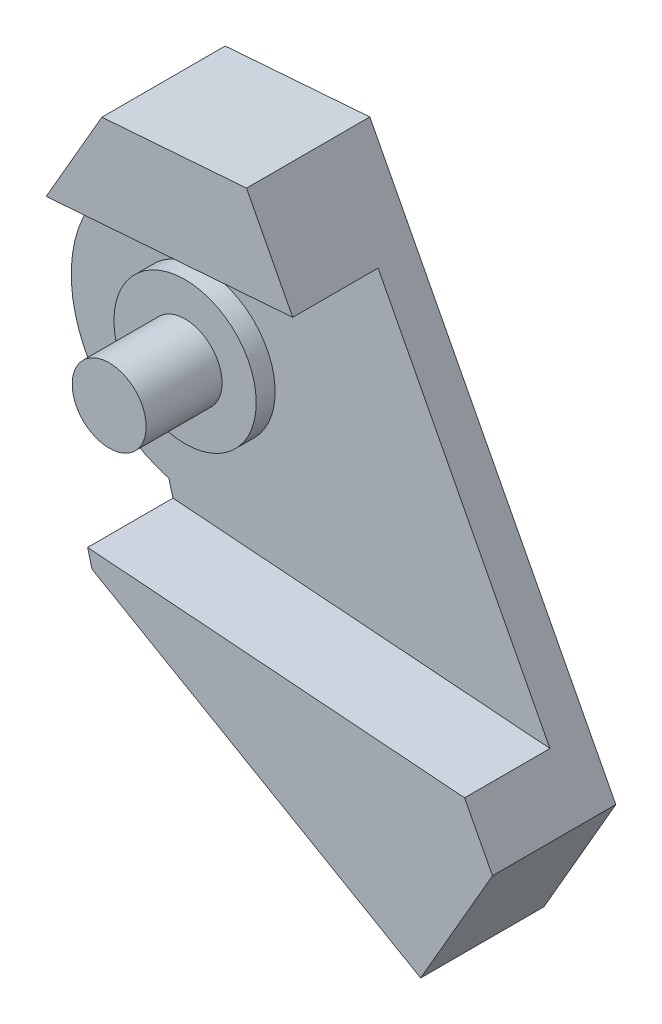
ISO-10303-21;
HEADER;
FILE_DESCRIPTION(('STEP AP214'),'2;1');
FILE_NAME('part.step','',(''),(''),'','','');
FILE_SCHEMA(('AUTOMOTIVE_DESIGN { 1 0 10303 214 1 1 1 1 }'));
ENDSEC;
DATA;
#1=APPLICATION_CONTEXT('core data for automotive mechanical design processes');
#2=APPLICATION_PROTOCOL_DEFINITION('international standard','automotive_design',2000,#1);
#3=PRODUCT_CONTEXT('',#1,'mechanical');
#4=PRODUCT('Part','Part','',(#3));
#5=PRODUCT_RELATED_PRODUCT_CATEGORY('part','',(#4));
#6=PRODUCT_DEFINITION_FORMATION('','',#4);
#7=PRODUCT_DEFINITION_CONTEXT('part definition',#1,'design');
#8=PRODUCT_DEFINITION('design','',#6,#7);
#9=PRODUCT_DEFINITION_SHAPE('','',#8);
#10=(LENGTH_UNIT() NAMED_UNIT(*) SI_UNIT(.MILLI.,.METRE.));
#11=(NAMED_UNIT(*) PLANE_ANGLE_UNIT() SI_UNIT($,.RADIAN.));
#12=(NAMED_UNIT(*) SI_UNIT($,.STERADIAN.) SOLID_ANGLE_UNIT());
#13=UNCERTAINTY_MEASURE_WITH_UNIT(LENGTH_MEASURE(1.E-05),#10,'distance_accuracy_value','');
#14=(GEOMETRIC_REPRESENTATION_CONTEXT(3) GLOBAL_UNCERTAINTY_ASSIGNED_CONTEXT((#13)) GLOBAL_UNIT_ASSIGNED_CONTEXT((#10,
#11,#12)) REPRESENTATION_CONTEXT('',''));
#15=CARTESIAN_POINT('',(0.,0.,0.));
#16=DIRECTION('',(0.,0.,1.));
#17=DIRECTION('',(1.,0.,0.));
#18=AXIS2_PLACEMENT_3D('',#15,#16,#17);
#19=CARTESIAN_POINT('',(0.,0.,-6.99999999999928));
#20=DIRECTION('',(0.,0.,-1.));
#21=DIRECTION('',(-1.,0.,0.));
#22=AXIS2_PLACEMENT_3D('',#19,#20,#21);
#23=PLANE('',#22);
#24=CARTESIAN_POINT('',(-59.9999999999944,0.,-6.99999999999928));
#25=DIRECTION('',(0.,0.,-1.));
#26=DIRECTION('',(-1.,0.,0.));
#27=AXIS2_PLACEMENT_3D('',#24,#25,#26);
#28=CIRCLE('',#27,3.75);
#29=CARTESIAN_POINT('',(-63.7499999999944,0.,-6.99999999999928));
#30=VERTEX_POINT('',#29);
#31=EDGE_CURVE('E11',#30,#30,#28,.F.);
#32=ORIENTED_EDGE('',*,*,#31,.F.);
#33=EDGE_LOOP('',(#32));
#34=FACE_BOUND('',#33,.T.);
#35=DIRECTION('',(-0.5,-0.866025403784439,0.));
#36=VECTOR('',#35,1.);
#37=CARTESIAN_POINT('',(-70.0621778264898,-3.42820323027366,-6.99999999999928));
#38=LINE('',#37,#36);
#39=CARTESIAN_POINT('',(-63.819558369945,7.38433084077987,-6.99999999999928));
#40=VERTEX_POINT('',#39);
#41=CARTESIAN_POINT('',(-66.0621778264895,3.50000000000232,-6.99999999999928));
#42=VERTEX_POINT('',#41);
#43=EDGE_CURVE('E137',#40,#42,#38,.T.);
#44=ORIENTED_EDGE('',*,*,#43,.T.);
#45=CARTESIAN_POINT('',(-59.9999999999944,0.,-6.99999999999928));
#46=DIRECTION('',(0.,0.,-1.));
#47=DIRECTION('',(-1.,0.,0.));
#48=AXIS2_PLACEMENT_3D('',#45,#46,#47);
#49=CIRCLE('',#48,7.00000000000463);
#50=CARTESIAN_POINT('',(-61.8514022990504,-6.75072659253172,-6.99999999999928));
#51=VERTEX_POINT('',#50);
#52=EDGE_CURVE('E107',#42,#51,#49,.F.);
#53=ORIENTED_EDGE('',*,*,#52,.T.);
#54=DIRECTION('',(0.258819045102521,-0.965925826289068,0.));
#55=VECTOR('',#54,1.);
#56=CARTESIAN_POINT('',(-59.3958256229926,-15.9150635094607,-6.99999999999928));
#57=LINE('',#56,#55);
#58=CARTESIAN_POINT('',(-61.6376568001871,-7.54843565417865,-6.99999999999928));
#59=VERTEX_POINT('',#58);
#60=EDGE_CURVE('E164',#51,#59,#57,.T.);
#61=ORIENTED_EDGE('',*,*,#60,.T.);
#62=DIRECTION('',(-0.997183533758957,0.075,0.));
#63=VECTOR('',#62,1.);
#64=CARTESIAN_POINT('',(-0.91125,-12.1157799351713,-6.99999999999928));
#65=LINE('',#64,#63);
#66=CARTESIAN_POINT('',(-41.7638339135907,-9.04318227406721,-6.99999999999928));
#67=VERTEX_POINT('',#66);
#68=EDGE_CURVE('E39',#67,#59,#65,.T.);
#69=ORIENTED_EDGE('',*,*,#68,.F.);
#70=DIRECTION('',(-0.461748613235033,0.887010833178222,0.));
#71=VECTOR('',#70,1.);
#72=CARTESIAN_POINT('',(-40.2935894276389,-11.8674956538585,-6.99999999999928));
#73=LINE('',#72,#71);
#74=CARTESIAN_POINT('',(-50.8242583631366,8.36173115628311,-6.99999999999928));
#75=VERTEX_POINT('',#74);
#76=EDGE_CURVE('E135',#67,#75,#73,.T.);
#77=ORIENTED_EDGE('',*,*,#76,.T.);
#78=DIRECTION('',(-0.997183533758957,-0.075,0.));
#79=VECTOR('',#78,1.);
#80=CARTESIAN_POINT('',(-0.91125,12.1157799351713,-6.99999999999928));
#81=LINE('',#80,#79);
#82=EDGE_CURVE('E185',#75,#40,#81,.T.);
#83=ORIENTED_EDGE('',*,*,#82,.T.);
#84=EDGE_LOOP('',(#44,#53,#61,#69,#77,#83));
#85=FACE_BOUND('',#84,.T.);
#86=ADVANCED_FACE('F16',(#34,#85),#23,.F.);
#87=CARTESIAN_POINT('',(-40.2935894276389,-11.8674956538585,-8.99999999999928));
#88=DIRECTION('',(0.866025403784439,-0.5,0.));
#89=DIRECTION('',(0.5,0.866025403784439,0.));
#90=AXIS2_PLACEMENT_3D('',#87,#88,#89);
#91=PLANE('',#90);
#92=DIRECTION('',(0.,0.,1.));
#93=VECTOR('',#92,1.);
#94=CARTESIAN_POINT('',(-40.2935894276389,-11.8674956538585,-8.99999999999928));
#95=LINE('',#94,#93);
#96=CARTESIAN_POINT('',(-40.2935894276389,-11.8674956538585,-8.99999999999928));
#97=VERTEX_POINT('',#96);
#98=CARTESIAN_POINT('',(-40.2935894276389,-11.8674956538585,-2.49999999999928));
#99=VERTEX_POINT('',#98);
#100=EDGE_CURVE('E129',#97,#99,#95,.T.);
#101=ORIENTED_EDGE('',*,*,#100,.T.);
#102=DIRECTION('',(0.5,0.866025403784439,0.));
#103=VECTOR('',#102,1.);
#104=CARTESIAN_POINT('',(-25.0814157129578,14.480762113533,-2.49999999999928));
#105=LINE('',#104,#103);
#106=CARTESIAN_POINT('',(-44.0814157129566,-18.4282032302736,-2.49999999999928));
#107=VERTEX_POINT('',#106);
#108=EDGE_CURVE('E178',#107,#99,#105,.T.);
#109=ORIENTED_EDGE('',*,*,#108,.F.);
#110=DIRECTION('',(0.,0.,1.));
#111=VECTOR('',#110,1.);
#112=CARTESIAN_POINT('',(-44.0814157129566,-18.4282032302736,-8.99999999999928));
#113=LINE('',#112,#111);
#114=CARTESIAN_POINT('',(-44.0814157129566,-18.4282032302736,-8.99999999999928));
#115=VERTEX_POINT('',#114);
#116=EDGE_CURVE('E141',#115,#107,#113,.T.);
#117=ORIENTED_EDGE('',*,*,#116,.F.);
#118=DIRECTION('',(0.5,0.866025403784439,0.));
#119=VECTOR('',#118,1.);
#120=CARTESIAN_POINT('',(-40.2935894276389,-11.8674956538585,-8.99999999999928));
#121=LINE('',#120,#119);
#122=EDGE_CURVE('E140',#115,#97,#121,.T.);
#123=ORIENTED_EDGE('',*,*,#122,.T.);
#124=EDGE_LOOP('',(#101,#109,#117,#123));
#125=FACE_BOUND('',#124,.T.);
#126=ADVANCED_FACE('F18',(#125),#91,.T.);
#127=CARTESIAN_POINT('',(-44.0814157129566,-18.4282032302736,-8.99999999999928));
#128=DIRECTION('',(-0.5,-0.866025403784439,0.));
#129=DIRECTION('',(0.866025403784439,-0.5,0.));
#130=AXIS2_PLACEMENT_3D('',#127,#128,#129);
#131=PLANE('',#130);
#132=DIRECTION('',(0.,0.,1.));
#133=VECTOR('',#132,1.);
#134=CARTESIAN_POINT('',(-61.4019237886454,-8.42820323027366,-8.99999999999928));
#135=LINE('',#134,#133);
#136=CARTESIAN_POINT('',(-61.4019237886454,-8.42820323027366,-8.99999999999928));
#137=VERTEX_POINT('',#136);
#138=CARTESIAN_POINT('',(-61.4019237886454,-8.42820323027365,-2.49999999999928));
#139=VERTEX_POINT('',#138);
#140=EDGE_CURVE('E31',#137,#139,#135,.T.);
#141=ORIENTED_EDGE('',*,*,#140,.F.);
#142=DIRECTION('',(0.866025403784439,-0.5,0.));
#143=VECTOR('',#142,1.);
#144=CARTESIAN_POINT('',(-44.0814157129566,-18.4282032302736,-8.99999999999928));
#145=LINE('',#144,#143);
#146=EDGE_CURVE('E126',#137,#115,#145,.T.);
#147=ORIENTED_EDGE('',*,*,#146,.T.);
#148=ORIENTED_EDGE('',*,*,#116,.T.);
#149=DIRECTION('',(0.866025403784439,-0.5,0.));
#150=VECTOR('',#149,1.);
#151=CARTESIAN_POINT('',(-18.9999999999988,-32.9089653438067,-2.49999999999928));
#152=LINE('',#151,#150);
#153=EDGE_CURVE('E176',#139,#107,#152,.T.);
#154=ORIENTED_EDGE('',*,*,#153,.F.);
#155=EDGE_LOOP('',(#141,#147,#148,#154));
#156=FACE_BOUND('',#155,.T.);
#157=ADVANCED_FACE('F216',(#156),#131,.T.);
#158=CARTESIAN_POINT('',(-70.0621778264898,-3.42820323027366,-8.99999999999928));
#159=DIRECTION('',(-0.866025403784439,0.5,0.));
#160=DIRECTION('',(-0.5,-0.866025403784439,0.));
#161=AXIS2_PLACEMENT_3D('',#158,#159,#160);
#162=PLANE('',#161);
#163=DIRECTION('',(0.,0.,1.));
#164=VECTOR('',#163,1.);
#165=CARTESIAN_POINT('',(-66.0621778264895,3.50000000000232,-8.99999999999928));
#166=LINE('',#165,#164);
#167=CARTESIAN_POINT('',(-66.0621778264895,3.50000000000232,-8.99999999999928));
#168=VERTEX_POINT('',#167);
#169=EDGE_CURVE('E100',#168,#42,#166,.T.);
#170=ORIENTED_EDGE('',*,*,#169,.T.);
#171=ORIENTED_EDGE('',*,*,#43,.F.);
#172=DIRECTION('',(0.,0.,-1.));
#173=VECTOR('',#172,1.);
#174=CARTESIAN_POINT('',(-63.819558369945,7.38433084077987,-2.49999999999928));
#175=LINE('',#174,#173);
#176=CARTESIAN_POINT('',(-63.819558369945,7.38433084077987,-2.49999999999928));
#177=VERTEX_POINT('',#176);
#178=EDGE_CURVE('E197',#177,#40,#175,.T.);
#179=ORIENTED_EDGE('',*,*,#178,.F.);
#180=DIRECTION('',(-0.5,-0.866025403784439,0.));
#181=VECTOR('',#180,1.);
#182=CARTESIAN_POINT('',(-51.0621778264909,29.480762113533,-2.49999999999928));
#183=LINE('',#182,#181);
#184=CARTESIAN_POINT('',(-60.8840296233567,12.4688157769498,-2.49999999999928));
#185=VERTEX_POINT('',#184);
#186=EDGE_CURVE('E195',#185,#177,#183,.T.);
#187=ORIENTED_EDGE('',*,*,#186,.F.);
#188=DIRECTION('',(0.,0.,1.));
#189=VECTOR('',#188,1.);
#190=CARTESIAN_POINT('',(-60.8840296233567,12.4688157769498,-8.99999999999928));
#191=LINE('',#190,#189);
#192=CARTESIAN_POINT('',(-60.8840296233567,12.4688157769498,-8.99999999999928));
#193=VERTEX_POINT('',#192);
#194=EDGE_CURVE('E125',#193,#185,#191,.T.);
#195=ORIENTED_EDGE('',*,*,#194,.F.);
#196=DIRECTION('',(-0.5,-0.866025403784439,0.));
#197=VECTOR('',#196,1.);
#198=CARTESIAN_POINT('',(-70.0621778264898,-3.42820323027366,-8.99999999999928));
#199=LINE('',#198,#197);
#200=EDGE_CURVE('E118',#193,#168,#199,.T.);
#201=ORIENTED_EDGE('',*,*,#200,.T.);
#202=EDGE_LOOP('',(#170,#171,#179,#187,#195,#201));
#203=FACE_BOUND('',#202,.T.);
#204=ADVANCED_FACE('F123',(#203),#162,.T.);
#205=CARTESIAN_POINT('',(-60.8840296233567,12.4688157769498,-8.99999999999928));
#206=DIRECTION('',(-0.075,0.997183533758957,0.));
#207=DIRECTION('',(-0.997183533758957,-0.075,0.));
#208=AXIS2_PLACEMENT_3D('',#205,#206,#207);
#209=PLANE('',#208);
#210=ORIENTED_EDGE('',*,*,#194,.T.);
#211=DIRECTION('',(-0.997183533758957,-0.075,0.));
#212=VECTOR('',#211,1.);
#213=CARTESIAN_POINT('',(-1.275,16.9521200739023,-2.49999999999928));
#214=LINE('',#213,#212);
#215=CARTESIAN_POINT('',(-53.2607442675367,13.042177031253,-2.49999999999928));
#216=VERTEX_POINT('',#215);
#217=EDGE_CURVE('E192',#216,#185,#214,.T.);
#218=ORIENTED_EDGE('',*,*,#217,.F.);
#219=DIRECTION('',(0.,0.,1.));
#220=VECTOR('',#219,1.);
#221=CARTESIAN_POINT('',(-53.2607442675367,13.042177031253,-8.99999999999928));
#222=LINE('',#221,#220);
#223=CARTESIAN_POINT('',(-53.2607442675367,13.042177031253,-8.99999999999928));
#224=VERTEX_POINT('',#223);
#225=EDGE_CURVE('E145',#224,#216,#222,.T.);
#226=ORIENTED_EDGE('',*,*,#225,.F.);
#227=DIRECTION('',(-0.997183533758957,-0.075,0.));
#228=VECTOR('',#227,1.);
#229=CARTESIAN_POINT('',(-60.8840296233567,12.4688157769498,-8.99999999999928));
#230=LINE('',#229,#228);
#231=EDGE_CURVE('E127',#224,#193,#230,.T.);
#232=ORIENTED_EDGE('',*,*,#231,.T.);
#233=EDGE_LOOP('',(#210,#218,#226,#232));
#234=FACE_BOUND('',#233,.T.);
#235=ADVANCED_FACE('F232',(#234),#209,.T.);
#236=CARTESIAN_POINT('',(-40.2935894276389,-11.8674956538585,-8.99999999999928));
#237=DIRECTION('',(0.887010833178222,0.461748613235033,0.));
#238=DIRECTION('',(-0.461748613235033,0.887010833178222,0.));
#239=AXIS2_PLACEMENT_3D('',#236,#237,#238);
#240=PLANE('',#239);
#241=ORIENTED_EDGE('',*,*,#76,.F.);
#242=DIRECTION('',(0.,0.,-1.));
#243=VECTOR('',#242,1.);
#244=CARTESIAN_POINT('',(-41.7638339135907,-9.04318227406721,-2.49999999999928));
#245=LINE('',#244,#243);
#246=CARTESIAN_POINT('',(-41.7638339135907,-9.04318227406721,-2.49999999999928));
#247=VERTEX_POINT('',#246);
#248=EDGE_CURVE('E181',#247,#67,#245,.T.);
#249=ORIENTED_EDGE('',*,*,#248,.F.);
#250=DIRECTION('',(-0.461748613235033,0.887010833178222,0.));
#251=VECTOR('',#250,1.);
#252=CARTESIAN_POINT('',(-36.5631630923926,-19.0335779698492,-2.49999999999928));
#253=LINE('',#252,#251);
#254=EDGE_CURVE('E170',#99,#247,#253,.T.);
#255=ORIENTED_EDGE('',*,*,#254,.F.);
#256=ORIENTED_EDGE('',*,*,#100,.F.);
#257=DIRECTION('',(-0.461748613235033,0.887010833178222,0.));
#258=VECTOR('',#257,1.);
#259=CARTESIAN_POINT('',(-40.2935894276389,-11.8674956538585,-8.99999999999928));
#260=LINE('',#259,#258);
#261=EDGE_CURVE('E131',#97,#224,#260,.T.);
#262=ORIENTED_EDGE('',*,*,#261,.T.);
#263=ORIENTED_EDGE('',*,*,#225,.T.);
#264=DIRECTION('',(-0.461748613235033,0.887010833178222,0.));
#265=VECTOR('',#264,1.);
#266=CARTESIAN_POINT('',(-36.5631630923926,-19.0335779698492,-2.49999999999928));
#267=LINE('',#266,#265);
#268=CARTESIAN_POINT('',(-50.8242583631366,8.36173115628311,-2.49999999999928));
#269=VERTEX_POINT('',#268);
#270=EDGE_CURVE('E189',#269,#216,#267,.T.);
#271=ORIENTED_EDGE('',*,*,#270,.F.);
#272=DIRECTION('',(0.,0.,-1.));
#273=VECTOR('',#272,1.);
#274=CARTESIAN_POINT('',(-50.8242583631366,8.36173115628311,-2.49999999999928));
#275=LINE('',#274,#273);
#276=EDGE_CURVE('E138',#269,#75,#275,.T.);
#277=ORIENTED_EDGE('',*,*,#276,.T.);
#278=EDGE_LOOP('',(#241,#249,#255,#256,#262,#263,#271,#277));
#279=FACE_BOUND('',#278,.T.);
#280=ADVANCED_FACE('F207',(#279),#240,.T.);
#281=CARTESIAN_POINT('',(0.,0.,-8.99999999999928));
#282=DIRECTION('',(0.,0.,-1.));
#283=DIRECTION('',(-1.,0.,0.));
#284=AXIS2_PLACEMENT_3D('',#281,#282,#283);
#285=PLANE('',#284);
#286=CARTESIAN_POINT('',(-59.9999999999944,0.,-8.99999999999928));
#287=DIRECTION('',(0.,0.,-1.));
#288=DIRECTION('',(1.,0.,0.));
#289=AXIS2_PLACEMENT_3D('',#286,#287,#288);
#290=CIRCLE('',#289,7.00000000000463);
#291=CARTESIAN_POINT('',(-61.8514022990504,-6.75072659253172,-8.99999999999928));
#292=VERTEX_POINT('',#291);
#293=EDGE_CURVE('E104',#292,#168,#290,.T.);
#294=ORIENTED_EDGE('',*,*,#293,.T.);
#295=ORIENTED_EDGE('',*,*,#200,.F.);
#296=ORIENTED_EDGE('',*,*,#231,.F.);
#297=ORIENTED_EDGE('',*,*,#261,.F.);
#298=ORIENTED_EDGE('',*,*,#122,.F.);
#299=ORIENTED_EDGE('',*,*,#146,.F.);
#300=DIRECTION('',(-0.258819045102521,0.965925826289068,0.));
#301=VECTOR('',#300,1.);
#302=CARTESIAN_POINT('',(-61.4019237886454,-8.42820323027366,-8.99999999999928));
#303=LINE('',#302,#301);
#304=EDGE_CURVE('E112',#137,#292,#303,.T.);
#305=ORIENTED_EDGE('',*,*,#304,.T.);
#306=EDGE_LOOP('',(#294,#295,#296,#297,#298,#299,#305));
#307=FACE_BOUND('',#306,.T.);
#308=ADVANCED_FACE('F116',(#307),#285,.T.);
#309=CARTESIAN_POINT('',(-0.91125,12.1157799351713,-2.49999999999928));
#310=DIRECTION('',(0.075,-0.997183533758957,0.));
#311=DIRECTION('',(0.997183533758957,0.075,0.));
#312=AXIS2_PLACEMENT_3D('',#309,#310,#311);
#313=PLANE('',#312);
#314=ORIENTED_EDGE('',*,*,#82,.F.);
#315=ORIENTED_EDGE('',*,*,#276,.F.);
#316=DIRECTION('',(-0.997183533758957,-0.075,0.));
#317=VECTOR('',#316,1.);
#318=CARTESIAN_POINT('',(-0.91125,12.1157799351713,-2.49999999999928));
#319=LINE('',#318,#317);
#320=EDGE_CURVE('E186',#269,#177,#319,.T.);
#321=ORIENTED_EDGE('',*,*,#320,.T.);
#322=ORIENTED_EDGE('',*,*,#178,.T.);
#323=EDGE_LOOP('',(#314,#315,#321,#322));
#324=FACE_BOUND('',#323,.T.);
#325=ADVANCED_FACE('F227',(#324),#313,.T.);
#326=CARTESIAN_POINT('',(0.,0.,-2.49999999999928));
#327=DIRECTION('',(0.,0.,1.));
#328=DIRECTION('',(1.,0.,0.));
#329=AXIS2_PLACEMENT_3D('',#326,#327,#328);
#330=PLANE('',#329);
#331=ORIENTED_EDGE('',*,*,#320,.F.);
#332=ORIENTED_EDGE('',*,*,#270,.T.);
#333=ORIENTED_EDGE('',*,*,#217,.T.);
#334=ORIENTED_EDGE('',*,*,#186,.T.);
#335=EDGE_LOOP('',(#331,#332,#333,#334));
#336=FACE_BOUND('',#335,.T.);
#337=ADVANCED_FACE('F229',(#336),#330,.T.);
#338=CARTESIAN_POINT('',(-0.91125,-12.1157799351713,-2.49999999999928));
#339=DIRECTION('',(-0.075,-0.997183533758957,0.));
#340=DIRECTION('',(0.997183533758957,-0.075,0.));
#341=AXIS2_PLACEMENT_3D('',#338,#339,#340);
#342=PLANE('',#341);
#343=ORIENTED_EDGE('',*,*,#68,.T.);
#344=DIRECTION('',(0.,0.,1.));
#345=VECTOR('',#344,1.);
#346=CARTESIAN_POINT('',(-61.6376568001871,-7.54843565417865,-2.49999999999928));
#347=LINE('',#346,#345);
#348=CARTESIAN_POINT('',(-61.6376568001871,-7.54843565417865,-2.49999999999928));
#349=VERTEX_POINT('',#348);
#350=EDGE_CURVE('E160',#59,#349,#347,.T.);
#351=ORIENTED_EDGE('',*,*,#350,.T.);
#352=DIRECTION('',(-0.997183533758957,0.075,0.));
#353=VECTOR('',#352,1.);
#354=CARTESIAN_POINT('',(-0.91125,-12.1157799351713,-2.49999999999928));
#355=LINE('',#354,#353);
#356=EDGE_CURVE('E173',#247,#349,#355,.T.);
#357=ORIENTED_EDGE('',*,*,#356,.F.);
#358=ORIENTED_EDGE('',*,*,#248,.T.);
#359=EDGE_LOOP('',(#343,#351,#357,#358));
#360=FACE_BOUND('',#359,.T.);
#361=ADVANCED_FACE('F221',(#360),#342,.F.);
#362=CARTESIAN_POINT('',(0.,0.,-2.49999999999928));
#363=DIRECTION('',(0.,0.,1.));
#364=DIRECTION('',(1.,0.,0.));
#365=AXIS2_PLACEMENT_3D('',#362,#363,#364);
#366=PLANE('',#365);
#367=DIRECTION('',(-0.258819045102521,0.965925826289068,0.));
#368=VECTOR('',#367,1.);
#369=CARTESIAN_POINT('',(-59.3958256229926,-15.9150635094607,-2.49999999999928));
#370=LINE('',#369,#368);
#371=EDGE_CURVE('E24',#139,#349,#370,.T.);
#372=ORIENTED_EDGE('',*,*,#371,.F.);
#373=ORIENTED_EDGE('',*,*,#153,.T.);
#374=ORIENTED_EDGE('',*,*,#108,.T.);
#375=ORIENTED_EDGE('',*,*,#254,.T.);
#376=ORIENTED_EDGE('',*,*,#356,.T.);
#377=EDGE_LOOP('',(#372,#373,#374,#375,#376));
#378=FACE_BOUND('',#377,.T.);
#379=ADVANCED_FACE('F218',(#378),#366,.T.);
#380=CARTESIAN_POINT('',(-59.9999999999944,0.,-8.99999999999928));
#381=DIRECTION('',(0.,0.,1.));
#382=DIRECTION('',(1.,0.,0.));
#383=AXIS2_PLACEMENT_3D('',#380,#381,#382);
#384=CYLINDRICAL_SURFACE('',#383,7.00000000000463);
#385=ORIENTED_EDGE('',*,*,#169,.F.);
#386=ORIENTED_EDGE('',*,*,#293,.F.);
#387=DIRECTION('',(0.,0.,1.));
#388=VECTOR('',#387,1.);
#389=CARTESIAN_POINT('',(-61.8514022990504,-6.75072659253172,-8.99999999999928));
#390=LINE('',#389,#388);
#391=EDGE_CURVE('E158',#292,#51,#390,.T.);
#392=ORIENTED_EDGE('',*,*,#391,.T.);
#393=ORIENTED_EDGE('',*,*,#52,.F.);
#394=EDGE_LOOP('',(#385,#386,#392,#393));
#395=FACE_BOUND('',#394,.T.);
#396=ADVANCED_FACE('F102',(#395),#384,.T.);
#397=CARTESIAN_POINT('',(-61.4019237886454,-8.42820323027366,-8.99999999999928));
#398=DIRECTION('',(0.965925826289068,0.258819045102521,0.));
#399=DIRECTION('',(-0.258819045102521,0.965925826289068,0.));
#400=AXIS2_PLACEMENT_3D('',#397,#398,#399);
#401=PLANE('',#400);
#402=ORIENTED_EDGE('',*,*,#391,.F.);
#403=ORIENTED_EDGE('',*,*,#304,.F.);
#404=ORIENTED_EDGE('',*,*,#140,.T.);
#405=ORIENTED_EDGE('',*,*,#371,.T.);
#406=ORIENTED_EDGE('',*,*,#350,.F.);
#407=ORIENTED_EDGE('',*,*,#60,.F.);
#408=EDGE_LOOP('',(#402,#403,#404,#405,#406,#407));
#409=FACE_BOUND('',#408,.T.);
#410=ADVANCED_FACE('F219',(#409),#401,.F.);
#411=CARTESIAN_POINT('',(-59.9999999999944,0.,-5.99999999999928));
#412=DIRECTION('',(0.,0.,-1.));
#413=DIRECTION('',(-1.,0.,0.));
#414=AXIS2_PLACEMENT_3D('',#411,#412,#413);
#415=CYLINDRICAL_SURFACE('',#414,3.75);
#416=CARTESIAN_POINT('',(-59.9999999999944,0.,-5.99999999999928));
#417=DIRECTION('',(0.,0.,1.));
#418=DIRECTION('',(1.,0.,0.));
#419=AXIS2_PLACEMENT_3D('',#416,#417,#418);
#420=CIRCLE('',#419,3.75);
#421=CARTESIAN_POINT('',(-56.2499999999944,0.,-5.99999999999928));
#422=VERTEX_POINT('',#421);
#423=EDGE_CURVE('E149',#422,#422,#420,.T.);
#424=ORIENTED_EDGE('',*,*,#423,.F.);
#425=EDGE_LOOP('',(#424));
#426=FACE_BOUND('',#425,.T.);
#427=ORIENTED_EDGE('',*,*,#31,.T.);
#428=EDGE_LOOP('',(#427));
#429=FACE_BOUND('',#428,.T.);
#430=ADVANCED_FACE('F334',(#426,#429),#415,.T.);
#431=CARTESIAN_POINT('',(-59.9999999999944,0.,-5.99999999999928));
#432=DIRECTION('',(0.,0.,1.));
#433=DIRECTION('',(1.,0.,0.));
#434=AXIS2_PLACEMENT_3D('',#431,#432,#433);
#435=PLANE('',#434);
#436=CARTESIAN_POINT('',(-59.9999999999944,0.,-5.99999999999928));
#437=DIRECTION('',(0.,0.,1.));
#438=DIRECTION('',(1.,0.,0.));
#439=AXIS2_PLACEMENT_3D('',#436,#437,#438);
#440=CIRCLE('',#439,1.95);
#441=CARTESIAN_POINT('',(-58.0499999999944,0.,-5.99999999999928));
#442=VERTEX_POINT('',#441);
#443=EDGE_CURVE('E121',#442,#442,#440,.T.);
#444=ORIENTED_EDGE('',*,*,#443,.F.);
#445=EDGE_LOOP('',(#444));
#446=FACE_BOUND('',#445,.T.);
#447=ORIENTED_EDGE('',*,*,#423,.T.);
#448=EDGE_LOOP('',(#447));
#449=FACE_BOUND('',#448,.T.);
#450=ADVANCED_FACE('F343',(#446,#449),#435,.T.);
#451=CARTESIAN_POINT('',(-59.9999999999944,0.,-1.99999999999928));
#452=DIRECTION('',(0.,0.,1.));
#453=DIRECTION('',(1.,0.,0.));
#454=AXIS2_PLACEMENT_3D('',#451,#452,#453);
#455=PLANE('',#454);
#456=CARTESIAN_POINT('',(-59.9999999999944,0.,-1.99999999999928));
#457=DIRECTION('',(0.,0.,1.));
#458=DIRECTION('',(1.,0.,0.));
#459=AXIS2_PLACEMENT_3D('',#456,#457,#458);
#460=CIRCLE('',#459,1.95);
#461=CARTESIAN_POINT('',(-58.0499999999944,0.,-1.99999999999928));
#462=VERTEX_POINT('',#461);
#463=EDGE_CURVE('E167',#462,#462,#460,.T.);
#464=ORIENTED_EDGE('',*,*,#463,.T.);
#465=EDGE_LOOP('',(#464));
#466=FACE_BOUND('',#465,.T.);
#467=ADVANCED_FACE('F353',(#466),#455,.T.);
#468=CARTESIAN_POINT('',(-59.9999999999944,0.,-1.99999999999928));
#469=DIRECTION('',(0.,0.,-1.));
#470=DIRECTION('',(-1.,0.,0.));
#471=AXIS2_PLACEMENT_3D('',#468,#469,#470);
#472=CYLINDRICAL_SURFACE('',#471,1.95);
#473=ORIENTED_EDGE('',*,*,#443,.T.);
#474=EDGE_LOOP('',(#473));
#475=FACE_BOUND('',#474,.T.);
#476=ORIENTED_EDGE('',*,*,#463,.F.);
#477=EDGE_LOOP('',(#476));
#478=FACE_BOUND('',#477,.T.);
#479=ADVANCED_FACE('F363',(#475,#478),#472,.T.);
#480=CLOSED_SHELL('',(#86,#126,#157,#204,#235,#280,#308,#325,#337,#361,#379,#396,#410,#430,#450,
#467,#479));
#481=MANIFOLD_SOLID_BREP('B1',#480);
#482=ADVANCED_BREP_SHAPE_REPRESENTATION('',(#18,#481),#14);
#483=SHAPE_DEFINITION_REPRESENTATION(#9,#482);
ENDSEC;
END-ISO-10303-21;
